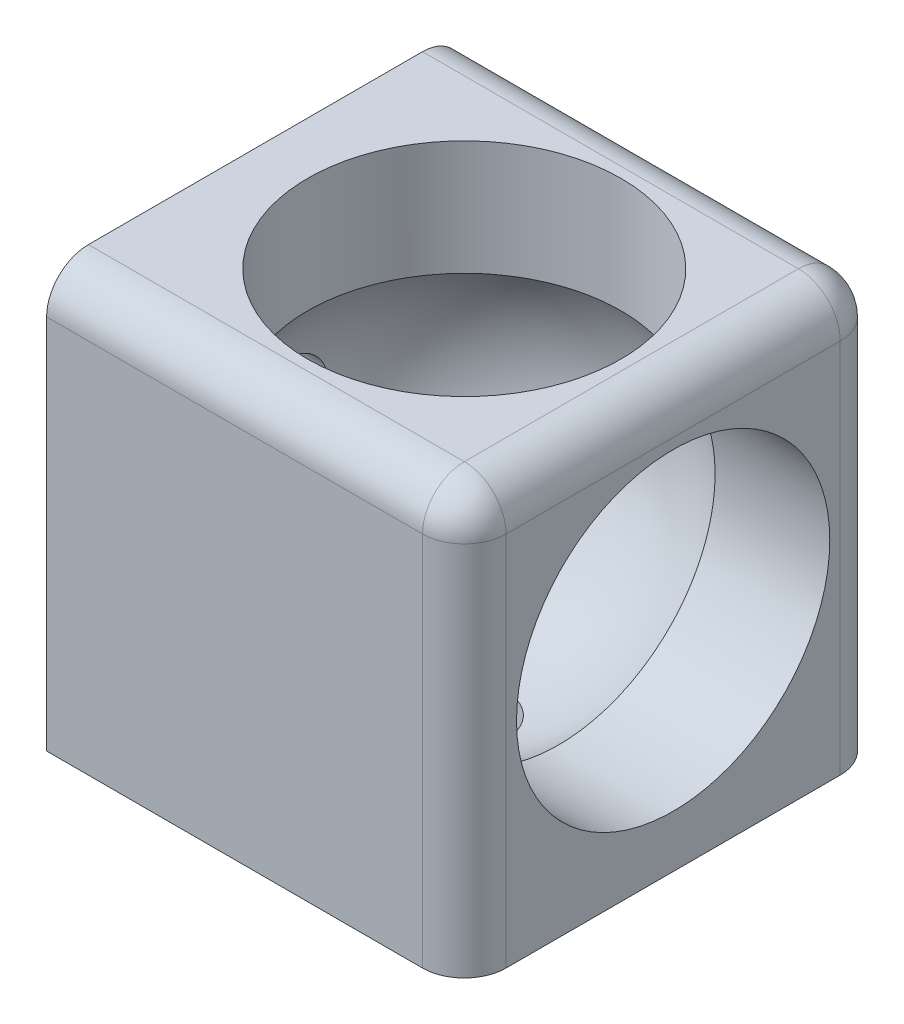
ISO-10303-21;
HEADER;
FILE_DESCRIPTION(('STEP AP214'),'2;1');
FILE_NAME('part.step','',(''),(''),'','','');
FILE_SCHEMA(('AUTOMOTIVE_DESIGN { 1 0 10303 214 1 1 1 1 }'));
ENDSEC;
DATA;
#1=APPLICATION_CONTEXT('core data for automotive mechanical design processes');
#2=APPLICATION_PROTOCOL_DEFINITION('international standard','automotive_design',2000,#1);
#3=PRODUCT_CONTEXT('',#1,'mechanical');
#4=PRODUCT('Part','Part','',(#3));
#5=PRODUCT_RELATED_PRODUCT_CATEGORY('part','',(#4));
#6=PRODUCT_DEFINITION_FORMATION('','',#4);
#7=PRODUCT_DEFINITION_CONTEXT('part definition',#1,'design');
#8=PRODUCT_DEFINITION('design','',#6,#7);
#9=PRODUCT_DEFINITION_SHAPE('','',#8);
#10=(LENGTH_UNIT() NAMED_UNIT(*) SI_UNIT(.MILLI.,.METRE.));
#11=(NAMED_UNIT(*) PLANE_ANGLE_UNIT() SI_UNIT($,.RADIAN.));
#12=(NAMED_UNIT(*) SI_UNIT($,.STERADIAN.) SOLID_ANGLE_UNIT());
#13=UNCERTAINTY_MEASURE_WITH_UNIT(LENGTH_MEASURE(1.E-05),#10,'distance_accuracy_value','');
#14=(GEOMETRIC_REPRESENTATION_CONTEXT(3) GLOBAL_UNCERTAINTY_ASSIGNED_CONTEXT((#13)) GLOBAL_UNIT_ASSIGNED_CONTEXT((#10,
#11,#12)) REPRESENTATION_CONTEXT('',''));
#15=CARTESIAN_POINT('',(0.,0.,0.));
#16=DIRECTION('',(0.,0.,1.));
#17=DIRECTION('',(1.,0.,0.));
#18=AXIS2_PLACEMENT_3D('',#15,#16,#17);
#19=CARTESIAN_POINT('',(-20.,20.,20.));
#20=DIRECTION('',(1.,0.,0.));
#21=DIRECTION('',(0.,0.,-1.));
#22=AXIS2_PLACEMENT_3D('',#19,#20,#21);
#23=PLANE('',#22);
#24=CARTESIAN_POINT('',(-20.,0.,0.));
#25=DIRECTION('',(-1.,0.,0.));
#26=DIRECTION('',(0.,0.,1.));
#27=AXIS2_PLACEMENT_3D('',#24,#25,#26);
#28=CIRCLE('',#27,4.);
#29=CARTESIAN_POINT('',(-20.,0.,4.));
#30=VERTEX_POINT('',#29);
#31=EDGE_CURVE('E138',#30,#30,#28,.T.);
#32=ORIENTED_EDGE('',*,*,#31,.F.);
#33=EDGE_LOOP('',(#32));
#34=FACE_BOUND('',#33,.T.);
#35=DIRECTION('',(0.,0.,1.));
#36=VECTOR('',#35,1.);
#37=CARTESIAN_POINT('',(-20.,20.,20.));
#38=LINE('',#37,#36);
#39=CARTESIAN_POINT('',(-20.,20.,-16.));
#40=VERTEX_POINT('',#39);
#41=CARTESIAN_POINT('',(-20.,20.,16.));
#42=VERTEX_POINT('',#41);
#43=EDGE_CURVE('E141',#40,#42,#38,.T.);
#44=ORIENTED_EDGE('',*,*,#43,.F.);
#45=CARTESIAN_POINT('',(-20.,16.,-16.));
#46=DIRECTION('',(1.,0.,0.));
#47=DIRECTION('',(0.,0.,-1.));
#48=AXIS2_PLACEMENT_3D('',#45,#46,#47);
#49=CIRCLE('',#48,4.);
#50=CARTESIAN_POINT('',(-20.,16.,-20.));
#51=VERTEX_POINT('',#50);
#52=EDGE_CURVE('E182',#40,#51,#49,.F.);
#53=ORIENTED_EDGE('',*,*,#52,.T.);
#54=DIRECTION('',(0.,-1.,0.));
#55=VECTOR('',#54,1.);
#56=CARTESIAN_POINT('',(-20.,20.,-20.));
#57=LINE('',#56,#55);
#58=CARTESIAN_POINT('',(-20.,-20.,-20.));
#59=VERTEX_POINT('',#58);
#60=EDGE_CURVE('E144',#51,#59,#57,.T.);
#61=ORIENTED_EDGE('',*,*,#60,.T.);
#62=DIRECTION('',(0.,0.,1.));
#63=VECTOR('',#62,1.);
#64=CARTESIAN_POINT('',(-20.,-20.,20.));
#65=LINE('',#64,#63);
#66=CARTESIAN_POINT('',(-20.,-20.,20.));
#67=VERTEX_POINT('',#66);
#68=EDGE_CURVE('E146',#59,#67,#65,.T.);
#69=ORIENTED_EDGE('',*,*,#68,.T.);
#70=DIRECTION('',(0.,-1.,0.));
#71=VECTOR('',#70,1.);
#72=CARTESIAN_POINT('',(-20.,20.,20.));
#73=LINE('',#72,#71);
#74=CARTESIAN_POINT('',(-20.,16.,20.));
#75=VERTEX_POINT('',#74);
#76=EDGE_CURVE('E157',#75,#67,#73,.T.);
#77=ORIENTED_EDGE('',*,*,#76,.F.);
#78=CARTESIAN_POINT('',(-20.,16.,16.));
#79=DIRECTION('',(1.,0.,0.));
#80=DIRECTION('',(0.,0.,-1.));
#81=AXIS2_PLACEMENT_3D('',#78,#79,#80);
#82=CIRCLE('',#81,4.);
#83=EDGE_CURVE('E180',#75,#42,#82,.F.);
#84=ORIENTED_EDGE('',*,*,#83,.T.);
#85=EDGE_LOOP('',(#44,#53,#61,#69,#77,#84));
#86=FACE_BOUND('',#85,.T.);
#87=ADVANCED_FACE('F35',(#34,#86),#23,.F.);
#88=CARTESIAN_POINT('',(20.,20.,20.));
#89=DIRECTION('',(0.,0.,-1.));
#90=DIRECTION('',(-1.,0.,0.));
#91=AXIS2_PLACEMENT_3D('',#88,#89,#90);
#92=PLANE('',#91);
#93=DIRECTION('',(0.,-1.,0.));
#94=VECTOR('',#93,1.);
#95=CARTESIAN_POINT('',(16.,20.,20.));
#96=LINE('',#95,#94);
#97=CARTESIAN_POINT('',(16.,-20.,20.));
#98=VERTEX_POINT('',#97);
#99=CARTESIAN_POINT('',(16.,16.,20.));
#100=VERTEX_POINT('',#99);
#101=EDGE_CURVE('E58',#98,#100,#96,.F.);
#102=ORIENTED_EDGE('',*,*,#101,.T.);
#103=DIRECTION('',(1.,0.,0.));
#104=VECTOR('',#103,1.);
#105=CARTESIAN_POINT('',(-20.,16.,20.));
#106=LINE('',#105,#104);
#107=EDGE_CURVE('E44',#100,#75,#106,.F.);
#108=ORIENTED_EDGE('',*,*,#107,.T.);
#109=ORIENTED_EDGE('',*,*,#76,.T.);
#110=DIRECTION('',(1.,0.,0.));
#111=VECTOR('',#110,1.);
#112=CARTESIAN_POINT('',(20.,-20.,20.));
#113=LINE('',#112,#111);
#114=EDGE_CURVE('E149',#67,#98,#113,.T.);
#115=ORIENTED_EDGE('',*,*,#114,.T.);
#116=EDGE_LOOP('',(#102,#108,#109,#115));
#117=FACE_BOUND('',#116,.T.);
#118=ADVANCED_FACE('F233',(#117),#92,.F.);
#119=CARTESIAN_POINT('',(20.,20.,20.));
#120=DIRECTION('',(-1.,0.,0.));
#121=DIRECTION('',(0.,0.,1.));
#122=AXIS2_PLACEMENT_3D('',#119,#120,#121);
#123=PLANE('',#122);
#124=CARTESIAN_POINT('',(20.,0.,0.));
#125=DIRECTION('',(1.,0.,0.));
#126=DIRECTION('',(0.,0.,-1.));
#127=AXIS2_PLACEMENT_3D('',#124,#125,#126);
#128=CIRCLE('',#127,15.);
#129=CARTESIAN_POINT('',(20.,0.,-15.));
#130=VERTEX_POINT('',#129);
#131=EDGE_CURVE('E113',#130,#130,#128,.T.);
#132=ORIENTED_EDGE('',*,*,#131,.F.);
#133=EDGE_LOOP('',(#132));
#134=FACE_BOUND('',#133,.T.);
#135=DIRECTION('',(0.,0.,-1.));
#136=VECTOR('',#135,1.);
#137=CARTESIAN_POINT('',(20.,-20.,20.));
#138=LINE('',#137,#136);
#139=CARTESIAN_POINT('',(20.,-20.,16.));
#140=VERTEX_POINT('',#139);
#141=CARTESIAN_POINT('',(20.,-20.,-16.));
#142=VERTEX_POINT('',#141);
#143=EDGE_CURVE('E151',#140,#142,#138,.T.);
#144=ORIENTED_EDGE('',*,*,#143,.T.);
#145=DIRECTION('',(0.,-1.,0.));
#146=VECTOR('',#145,1.);
#147=CARTESIAN_POINT('',(20.,20.,-16.));
#148=LINE('',#147,#146);
#149=CARTESIAN_POINT('',(20.,16.,-16.));
#150=VERTEX_POINT('',#149);
#151=EDGE_CURVE('E172',#142,#150,#148,.F.);
#152=ORIENTED_EDGE('',*,*,#151,.T.);
#153=DIRECTION('',(0.,0.,-1.));
#154=VECTOR('',#153,1.);
#155=CARTESIAN_POINT('',(20.,16.,20.));
#156=LINE('',#155,#154);
#157=CARTESIAN_POINT('',(20.,16.,16.));
#158=VERTEX_POINT('',#157);
#159=EDGE_CURVE('E168',#150,#158,#156,.F.);
#160=ORIENTED_EDGE('',*,*,#159,.T.);
#161=DIRECTION('',(0.,-1.,0.));
#162=VECTOR('',#161,1.);
#163=CARTESIAN_POINT('',(20.,20.,16.));
#164=LINE('',#163,#162);
#165=EDGE_CURVE('E170',#158,#140,#164,.T.);
#166=ORIENTED_EDGE('',*,*,#165,.T.);
#167=EDGE_LOOP('',(#144,#152,#160,#166));
#168=FACE_BOUND('',#167,.T.);
#169=ADVANCED_FACE('F235',(#134,#168),#123,.F.);
#170=CARTESIAN_POINT('',(20.,20.,-20.));
#171=DIRECTION('',(0.,0.,1.));
#172=DIRECTION('',(1.,0.,0.));
#173=AXIS2_PLACEMENT_3D('',#170,#171,#172);
#174=PLANE('',#173);
#175=DIRECTION('',(-1.,0.,0.));
#176=VECTOR('',#175,1.);
#177=CARTESIAN_POINT('',(20.,16.,-20.));
#178=LINE('',#177,#176);
#179=CARTESIAN_POINT('',(16.,16.,-20.));
#180=VERTEX_POINT('',#179);
#181=EDGE_CURVE('E159',#51,#180,#178,.F.);
#182=ORIENTED_EDGE('',*,*,#181,.T.);
#183=DIRECTION('',(0.,-1.,0.));
#184=VECTOR('',#183,1.);
#185=CARTESIAN_POINT('',(16.,20.,-20.));
#186=LINE('',#185,#184);
#187=CARTESIAN_POINT('',(16.,-20.,-20.));
#188=VERTEX_POINT('',#187);
#189=EDGE_CURVE('E161',#180,#188,#186,.T.);
#190=ORIENTED_EDGE('',*,*,#189,.T.);
#191=DIRECTION('',(-1.,0.,0.));
#192=VECTOR('',#191,1.);
#193=CARTESIAN_POINT('',(20.,-20.,-20.));
#194=LINE('',#193,#192);
#195=EDGE_CURVE('E145',#188,#59,#194,.T.);
#196=ORIENTED_EDGE('',*,*,#195,.T.);
#197=ORIENTED_EDGE('',*,*,#60,.F.);
#198=EDGE_LOOP('',(#182,#190,#196,#197));
#199=FACE_BOUND('',#198,.T.);
#200=ADVANCED_FACE('F222',(#199),#174,.F.);
#201=CARTESIAN_POINT('',(0.,20.,0.));
#202=DIRECTION('',(0.,1.,0.));
#203=DIRECTION('',(0.,0.,1.));
#204=AXIS2_PLACEMENT_3D('',#201,#202,#203);
#205=PLANE('',#204);
#206=CARTESIAN_POINT('',(0.,20.,0.));
#207=DIRECTION('',(0.,1.,0.));
#208=DIRECTION('',(0.,0.,1.));
#209=AXIS2_PLACEMENT_3D('',#206,#207,#208);
#210=CIRCLE('',#209,15.);
#211=CARTESIAN_POINT('',(0.,20.,15.));
#212=VERTEX_POINT('',#211);
#213=EDGE_CURVE('E112',#212,#212,#210,.T.);
#214=ORIENTED_EDGE('',*,*,#213,.F.);
#215=EDGE_LOOP('',(#214));
#216=FACE_BOUND('',#215,.T.);
#217=DIRECTION('',(0.,0.,-1.));
#218=VECTOR('',#217,1.);
#219=CARTESIAN_POINT('',(16.,20.,-20.));
#220=LINE('',#219,#218);
#221=CARTESIAN_POINT('',(16.,20.,16.));
#222=VERTEX_POINT('',#221);
#223=CARTESIAN_POINT('',(16.,20.,-16.));
#224=VERTEX_POINT('',#223);
#225=EDGE_CURVE('E174',#222,#224,#220,.T.);
#226=ORIENTED_EDGE('',*,*,#225,.T.);
#227=DIRECTION('',(-1.,0.,0.));
#228=VECTOR('',#227,1.);
#229=CARTESIAN_POINT('',(-20.,20.,-16.));
#230=LINE('',#229,#228);
#231=EDGE_CURVE('E178',#224,#40,#230,.T.);
#232=ORIENTED_EDGE('',*,*,#231,.T.);
#233=ORIENTED_EDGE('',*,*,#43,.T.);
#234=DIRECTION('',(1.,0.,0.));
#235=VECTOR('',#234,1.);
#236=CARTESIAN_POINT('',(20.,20.,16.));
#237=LINE('',#236,#235);
#238=EDGE_CURVE('E176',#42,#222,#237,.T.);
#239=ORIENTED_EDGE('',*,*,#238,.T.);
#240=EDGE_LOOP('',(#226,#232,#233,#239));
#241=FACE_BOUND('',#240,.T.);
#242=ADVANCED_FACE('F210',(#216,#241),#205,.T.);
#243=CARTESIAN_POINT('',(0.,-20.,0.));
#244=DIRECTION('',(0.,1.,0.));
#245=DIRECTION('',(0.,0.,1.));
#246=AXIS2_PLACEMENT_3D('',#243,#244,#245);
#247=PLANE('',#246);
#248=CARTESIAN_POINT('',(0.,-20.,0.));
#249=DIRECTION('',(0.,-1.,0.));
#250=DIRECTION('',(0.,0.,-1.));
#251=AXIS2_PLACEMENT_3D('',#248,#249,#250);
#252=CIRCLE('',#251,4.);
#253=CARTESIAN_POINT('',(0.,-20.,-4.));
#254=VERTEX_POINT('',#253);
#255=EDGE_CURVE('E128',#254,#254,#252,.T.);
#256=ORIENTED_EDGE('',*,*,#255,.F.);
#257=EDGE_LOOP('',(#256));
#258=FACE_BOUND('',#257,.T.);
#259=ORIENTED_EDGE('',*,*,#195,.F.);
#260=CARTESIAN_POINT('',(16.,-20.,-16.));
#261=DIRECTION('',(0.,1.,0.));
#262=DIRECTION('',(0.,0.,1.));
#263=AXIS2_PLACEMENT_3D('',#260,#261,#262);
#264=CIRCLE('',#263,4.);
#265=EDGE_CURVE('E166',#188,#142,#264,.F.);
#266=ORIENTED_EDGE('',*,*,#265,.T.);
#267=ORIENTED_EDGE('',*,*,#143,.F.);
#268=CARTESIAN_POINT('',(16.,-20.,16.));
#269=DIRECTION('',(0.,1.,0.));
#270=DIRECTION('',(0.,0.,1.));
#271=AXIS2_PLACEMENT_3D('',#268,#269,#270);
#272=CIRCLE('',#271,4.);
#273=EDGE_CURVE('E164',#140,#98,#272,.F.);
#274=ORIENTED_EDGE('',*,*,#273,.T.);
#275=ORIENTED_EDGE('',*,*,#114,.F.);
#276=ORIENTED_EDGE('',*,*,#68,.F.);
#277=EDGE_LOOP('',(#259,#266,#267,#274,#275,#276));
#278=FACE_BOUND('',#277,.T.);
#279=ADVANCED_FACE('F228',(#258,#278),#247,.F.);
#280=CARTESIAN_POINT('',(16.,20.,16.));
#281=DIRECTION('',(0.,-1.,0.));
#282=DIRECTION('',(0.,0.,-1.));
#283=AXIS2_PLACEMENT_3D('',#280,#281,#282);
#284=CYLINDRICAL_SURFACE('',#283,4.);
#285=ORIENTED_EDGE('',*,*,#273,.F.);
#286=ORIENTED_EDGE('',*,*,#165,.F.);
#287=CARTESIAN_POINT('',(16.,16.,16.));
#288=DIRECTION('',(0.,1.,0.));
#289=DIRECTION('',(0.,0.,1.));
#290=AXIS2_PLACEMENT_3D('',#287,#288,#289);
#291=CIRCLE('',#290,4.);
#292=EDGE_CURVE('E124',#100,#158,#291,.T.);
#293=ORIENTED_EDGE('',*,*,#292,.F.);
#294=ORIENTED_EDGE('',*,*,#101,.F.);
#295=EDGE_LOOP('',(#285,#286,#293,#294));
#296=FACE_BOUND('',#295,.T.);
#297=ADVANCED_FACE('F37',(#296),#284,.T.);
#298=CARTESIAN_POINT('',(0.,16.,16.));
#299=DIRECTION('',(-1.,0.,0.));
#300=DIRECTION('',(0.,0.,1.));
#301=AXIS2_PLACEMENT_3D('',#298,#299,#300);
#302=CYLINDRICAL_SURFACE('',#301,4.);
#303=ORIENTED_EDGE('',*,*,#83,.F.);
#304=ORIENTED_EDGE('',*,*,#107,.F.);
#305=CARTESIAN_POINT('',(16.,16.,16.));
#306=DIRECTION('',(1.,0.,0.));
#307=DIRECTION('',(0.,0.,-1.));
#308=AXIS2_PLACEMENT_3D('',#305,#306,#307);
#309=CIRCLE('',#308,4.);
#310=EDGE_CURVE('E193',#222,#100,#309,.T.);
#311=ORIENTED_EDGE('',*,*,#310,.F.);
#312=ORIENTED_EDGE('',*,*,#238,.F.);
#313=EDGE_LOOP('',(#303,#304,#311,#312));
#314=FACE_BOUND('',#313,.T.);
#315=ADVANCED_FACE('F232',(#314),#302,.T.);
#316=CARTESIAN_POINT('',(16.,16.,16.));
#317=DIRECTION('',(0.,0.,1.));
#318=DIRECTION('',(1.,0.,0.));
#319=AXIS2_PLACEMENT_3D('',#316,#317,#318);
#320=SPHERICAL_SURFACE('',#319,4.);
#321=ORIENTED_EDGE('',*,*,#310,.T.);
#322=ORIENTED_EDGE('',*,*,#292,.T.);
#323=CARTESIAN_POINT('',(16.,16.,16.));
#324=DIRECTION('',(0.,0.,1.));
#325=DIRECTION('',(1.,0.,0.));
#326=AXIS2_PLACEMENT_3D('',#323,#324,#325);
#327=CIRCLE('',#326,4.);
#328=EDGE_CURVE('E191',#222,#158,#327,.F.);
#329=ORIENTED_EDGE('',*,*,#328,.F.);
#330=EDGE_LOOP('',(#321,#322,#329));
#331=FACE_BOUND('',#330,.T.);
#332=ADVANCED_FACE('F200',(#331),#320,.T.);
#333=CARTESIAN_POINT('',(16.,16.,0.));
#334=DIRECTION('',(0.,0.,1.));
#335=DIRECTION('',(1.,0.,0.));
#336=AXIS2_PLACEMENT_3D('',#333,#334,#335);
#337=CYLINDRICAL_SURFACE('',#336,4.);
#338=ORIENTED_EDGE('',*,*,#328,.T.);
#339=ORIENTED_EDGE('',*,*,#159,.F.);
#340=CARTESIAN_POINT('',(16.,16.,-16.));
#341=DIRECTION('',(0.,0.,-1.));
#342=DIRECTION('',(-1.,0.,0.));
#343=AXIS2_PLACEMENT_3D('',#340,#341,#342);
#344=CIRCLE('',#343,4.);
#345=EDGE_CURVE('E188',#224,#150,#344,.T.);
#346=ORIENTED_EDGE('',*,*,#345,.F.);
#347=ORIENTED_EDGE('',*,*,#225,.F.);
#348=EDGE_LOOP('',(#338,#339,#346,#347));
#349=FACE_BOUND('',#348,.T.);
#350=ADVANCED_FACE('F206',(#349),#337,.T.);
#351=CARTESIAN_POINT('',(0.,16.,-16.));
#352=DIRECTION('',(1.,0.,0.));
#353=DIRECTION('',(0.,0.,-1.));
#354=AXIS2_PLACEMENT_3D('',#351,#352,#353);
#355=CYLINDRICAL_SURFACE('',#354,4.);
#356=ORIENTED_EDGE('',*,*,#52,.F.);
#357=ORIENTED_EDGE('',*,*,#231,.F.);
#358=CARTESIAN_POINT('',(16.,16.,-16.));
#359=DIRECTION('',(1.,0.,0.));
#360=DIRECTION('',(0.,0.,-1.));
#361=AXIS2_PLACEMENT_3D('',#358,#359,#360);
#362=CIRCLE('',#361,4.);
#363=EDGE_CURVE('E119',#180,#224,#362,.T.);
#364=ORIENTED_EDGE('',*,*,#363,.F.);
#365=ORIENTED_EDGE('',*,*,#181,.F.);
#366=EDGE_LOOP('',(#356,#357,#364,#365));
#367=FACE_BOUND('',#366,.T.);
#368=ADVANCED_FACE('F216',(#367),#355,.T.);
#369=CARTESIAN_POINT('',(16.,16.,-16.));
#370=DIRECTION('',(0.,1.,0.));
#371=DIRECTION('',(0.,0.,1.));
#372=AXIS2_PLACEMENT_3D('',#369,#370,#371);
#373=SPHERICAL_SURFACE('',#372,4.);
#374=ORIENTED_EDGE('',*,*,#363,.T.);
#375=ORIENTED_EDGE('',*,*,#345,.T.);
#376=CARTESIAN_POINT('',(16.,16.,-16.));
#377=DIRECTION('',(0.,1.,0.));
#378=DIRECTION('',(0.,0.,1.));
#379=AXIS2_PLACEMENT_3D('',#376,#377,#378);
#380=CIRCLE('',#379,4.);
#381=EDGE_CURVE('E116',#180,#150,#380,.F.);
#382=ORIENTED_EDGE('',*,*,#381,.F.);
#383=EDGE_LOOP('',(#374,#375,#382));
#384=FACE_BOUND('',#383,.T.);
#385=ADVANCED_FACE('F250',(#384),#373,.T.);
#386=CARTESIAN_POINT('',(16.,20.,-16.));
#387=DIRECTION('',(0.,-1.,0.));
#388=DIRECTION('',(0.,0.,-1.));
#389=AXIS2_PLACEMENT_3D('',#386,#387,#388);
#390=CYLINDRICAL_SURFACE('',#389,4.);
#391=ORIENTED_EDGE('',*,*,#381,.T.);
#392=ORIENTED_EDGE('',*,*,#151,.F.);
#393=ORIENTED_EDGE('',*,*,#265,.F.);
#394=ORIENTED_EDGE('',*,*,#189,.F.);
#395=EDGE_LOOP('',(#391,#392,#393,#394));
#396=FACE_BOUND('',#395,.T.);
#397=ADVANCED_FACE('F247',(#396),#390,.T.);
#398=CARTESIAN_POINT('',(0.,0.,0.));
#399=DIRECTION('',(0.,1.,0.));
#400=DIRECTION('',(0.,0.,1.));
#401=AXIS2_PLACEMENT_3D('',#398,#399,#400);
#402=CYLINDRICAL_SURFACE('',#401,15.);
#403=ORIENTED_EDGE('',*,*,#213,.T.);
#404=EDGE_LOOP('',(#403));
#405=FACE_BOUND('',#404,.T.);
#406=CARTESIAN_POINT('',(0.,9.01387818865998,0.));
#407=DIRECTION('',(0.,-1.,0.));
#408=DIRECTION('',(0.,0.,-1.));
#409=AXIS2_PLACEMENT_3D('',#406,#407,#408);
#410=CIRCLE('',#409,15.);
#411=CARTESIAN_POINT('',(9.01387818865998,9.01387818865998,-11.9895788082818));
#412=VERTEX_POINT('',#411);
#413=CARTESIAN_POINT('',(9.01387818865998,9.01387818865998,11.9895788082818));
#414=VERTEX_POINT('',#413);
#415=EDGE_CURVE('E111',#412,#414,#410,.F.);
#416=ORIENTED_EDGE('',*,*,#415,.F.);
#417=CARTESIAN_POINT('',(0.,0.,0.));
#418=DIRECTION('',(-0.707106781186547,0.707106781186547,0.));
#419=DIRECTION('',(0.707106781186547,0.707106781186547,0.));
#420=AXIS2_PLACEMENT_3D('',#417,#418,#419);
#421=ELLIPSE('',#420,21.2132034355964,15.);
#422=EDGE_CURVE('E51',#412,#414,#421,.F.);
#423=ORIENTED_EDGE('',*,*,#422,.T.);
#424=EDGE_LOOP('',(#416,#423));
#425=FACE_BOUND('',#424,.T.);
#426=ADVANCED_FACE('F110',(#405,#425),#402,.F.);
#427=CARTESIAN_POINT('',(0.,0.,0.));
#428=DIRECTION('',(0.,0.,-1.));
#429=DIRECTION('',(1.,0.,0.));
#430=AXIS2_PLACEMENT_3D('',#427,#428,#429);
#431=SPHERICAL_SURFACE('',#430,17.5);
#432=CARTESIAN_POINT('',(-17.0367250374008,0.,0.));
#433=DIRECTION('',(1.,0.,0.));
#434=DIRECTION('',(0.,0.,-1.));
#435=AXIS2_PLACEMENT_3D('',#432,#433,#434);
#436=CIRCLE('',#435,4.);
#437=CARTESIAN_POINT('',(-17.0367250374008,0.,-4.));
#438=VERTEX_POINT('',#437);
#439=EDGE_CURVE('E39',#438,#438,#436,.F.);
#440=ORIENTED_EDGE('',*,*,#439,.T.);
#441=EDGE_LOOP('',(#440));
#442=FACE_BOUND('',#441,.T.);
#443=CARTESIAN_POINT('',(0.,-17.0367250374008,0.));
#444=DIRECTION('',(0.,1.,0.));
#445=DIRECTION('',(0.,0.,1.));
#446=AXIS2_PLACEMENT_3D('',#443,#444,#445);
#447=CIRCLE('',#446,4.);
#448=CARTESIAN_POINT('',(0.,-17.0367250374008,4.));
#449=VERTEX_POINT('',#448);
#450=EDGE_CURVE('E126',#449,#449,#447,.F.);
#451=ORIENTED_EDGE('',*,*,#450,.T.);
#452=EDGE_LOOP('',(#451));
#453=FACE_BOUND('',#452,.T.);
#454=ORIENTED_EDGE('',*,*,#415,.T.);
#455=CARTESIAN_POINT('',(9.01387818865998,0.,0.));
#456=DIRECTION('',(-1.,0.,0.));
#457=DIRECTION('',(0.,0.,1.));
#458=AXIS2_PLACEMENT_3D('',#455,#456,#457);
#459=CIRCLE('',#458,15.);
#460=EDGE_CURVE('E11',#414,#412,#459,.F.);
#461=ORIENTED_EDGE('',*,*,#460,.T.);
#462=EDGE_LOOP('',(#454,#461));
#463=FACE_BOUND('',#462,.T.);
#464=ADVANCED_FACE('F115',(#442,#453,#463),#431,.F.);
#465=CARTESIAN_POINT('',(0.,0.,0.));
#466=DIRECTION('',(1.,0.,0.));
#467=DIRECTION('',(0.,0.,-1.));
#468=AXIS2_PLACEMENT_3D('',#465,#466,#467);
#469=CYLINDRICAL_SURFACE('',#468,15.);
#470=ORIENTED_EDGE('',*,*,#131,.T.);
#471=EDGE_LOOP('',(#470));
#472=FACE_BOUND('',#471,.T.);
#473=ORIENTED_EDGE('',*,*,#460,.F.);
#474=ORIENTED_EDGE('',*,*,#422,.F.);
#475=EDGE_LOOP('',(#473,#474));
#476=FACE_BOUND('',#475,.T.);
#477=ADVANCED_FACE('F105',(#472,#476),#469,.F.);
#478=CARTESIAN_POINT('',(0.,0.,0.));
#479=DIRECTION('',(0.,-1.,0.));
#480=DIRECTION('',(0.,0.,-1.));
#481=AXIS2_PLACEMENT_3D('',#478,#479,#480);
#482=CYLINDRICAL_SURFACE('',#481,4.);
#483=ORIENTED_EDGE('',*,*,#255,.T.);
#484=EDGE_LOOP('',(#483));
#485=FACE_BOUND('',#484,.T.);
#486=ORIENTED_EDGE('',*,*,#450,.F.);
#487=EDGE_LOOP('',(#486));
#488=FACE_BOUND('',#487,.T.);
#489=ADVANCED_FACE('F319',(#485,#488),#482,.F.);
#490=CARTESIAN_POINT('',(0.,0.,0.));
#491=DIRECTION('',(-1.,0.,0.));
#492=DIRECTION('',(0.,0.,1.));
#493=AXIS2_PLACEMENT_3D('',#490,#491,#492);
#494=CYLINDRICAL_SURFACE('',#493,4.);
#495=ORIENTED_EDGE('',*,*,#31,.T.);
#496=EDGE_LOOP('',(#495));
#497=FACE_BOUND('',#496,.T.);
#498=ORIENTED_EDGE('',*,*,#439,.F.);
#499=EDGE_LOOP('',(#498));
#500=FACE_BOUND('',#499,.T.);
#501=ADVANCED_FACE('F334',(#497,#500),#494,.F.);
#502=CLOSED_SHELL('',(#87,#118,#169,#200,#242,#279,#297,#315,#332,#350,#368,#385,#397,#426,#464,
#477,#489,#501));
#503=MANIFOLD_SOLID_BREP('B2',#502);
#504=ADVANCED_BREP_SHAPE_REPRESENTATION('',(#18,#503),#14);
#505=SHAPE_DEFINITION_REPRESENTATION(#9,#504);
ENDSEC;
END-ISO-10303-21;
